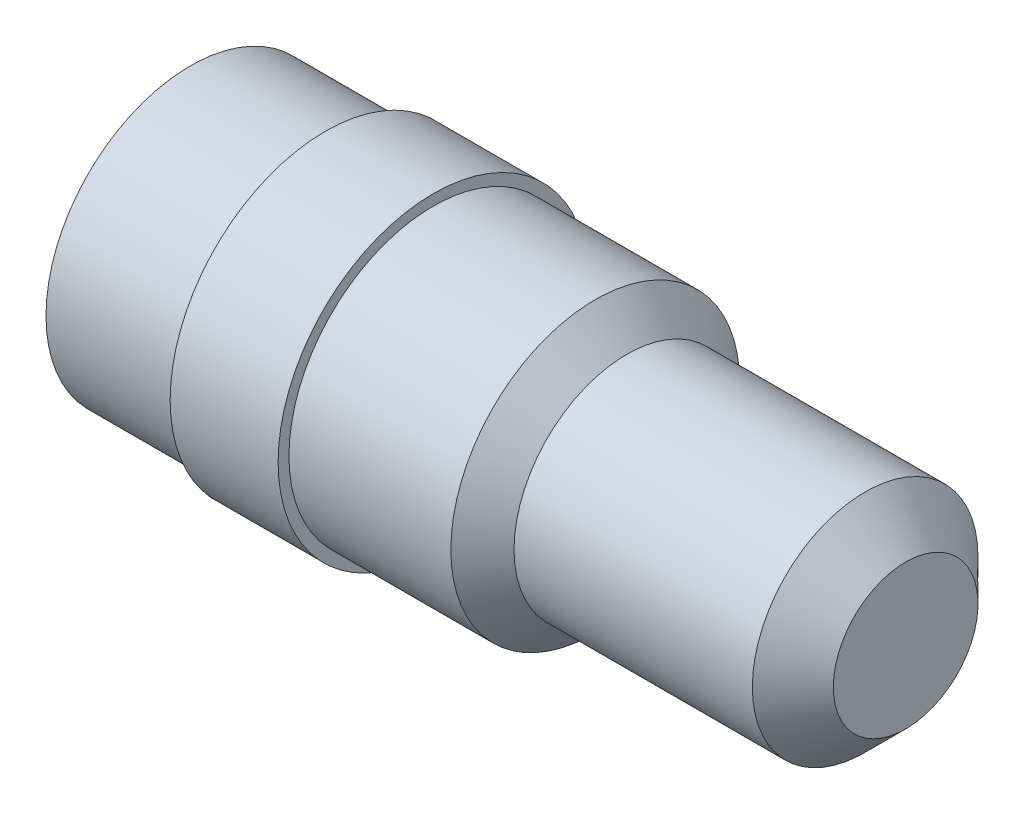
ISO-10303-21;
HEADER;
FILE_DESCRIPTION(('STEP AP214'),'2;1');
FILE_NAME('part.step','',(''),(''),'','','');
FILE_SCHEMA(('AUTOMOTIVE_DESIGN { 1 0 10303 214 1 1 1 1 }'));
ENDSEC;
DATA;
#1=APPLICATION_CONTEXT('core data for automotive mechanical design processes');
#2=APPLICATION_PROTOCOL_DEFINITION('international standard','automotive_design',2000,#1);
#3=PRODUCT_CONTEXT('',#1,'mechanical');
#4=PRODUCT('Part','Part','',(#3));
#5=PRODUCT_RELATED_PRODUCT_CATEGORY('part','',(#4));
#6=PRODUCT_DEFINITION_FORMATION('','',#4);
#7=PRODUCT_DEFINITION_CONTEXT('part definition',#1,'design');
#8=PRODUCT_DEFINITION('design','',#6,#7);
#9=PRODUCT_DEFINITION_SHAPE('','',#8);
#10=(LENGTH_UNIT() NAMED_UNIT(*) SI_UNIT(.MILLI.,.METRE.));
#11=(NAMED_UNIT(*) PLANE_ANGLE_UNIT() SI_UNIT($,.RADIAN.));
#12=(NAMED_UNIT(*) SI_UNIT($,.STERADIAN.) SOLID_ANGLE_UNIT());
#13=UNCERTAINTY_MEASURE_WITH_UNIT(LENGTH_MEASURE(1.E-05),#10,'distance_accuracy_value','');
#14=(GEOMETRIC_REPRESENTATION_CONTEXT(3) GLOBAL_UNCERTAINTY_ASSIGNED_CONTEXT((#13)) GLOBAL_UNIT_ASSIGNED_CONTEXT((#10,
#11,#12)) REPRESENTATION_CONTEXT('',''));
#15=CARTESIAN_POINT('',(0.,0.,0.));
#16=DIRECTION('',(0.,0.,1.));
#17=DIRECTION('',(1.,0.,0.));
#18=AXIS2_PLACEMENT_3D('',#15,#16,#17);
#19=CARTESIAN_POINT('',(0.,5.35,0.));
#20=DIRECTION('',(1.,0.,0.));
#21=DIRECTION('',(0.,0.,-1.));
#22=AXIS2_PLACEMENT_3D('',#19,#20,#21);
#23=PLANE('',#22);
#24=CARTESIAN_POINT('',(0.,0.,0.));
#25=DIRECTION('',(-1.,0.,0.));
#26=DIRECTION('',(0.,0.,1.));
#27=AXIS2_PLACEMENT_3D('',#24,#25,#26);
#28=CIRCLE('',#27,5.35);
#29=CARTESIAN_POINT('',(0.,0.,5.35));
#30=VERTEX_POINT('',#29);
#31=EDGE_CURVE('E62',#30,#30,#28,.T.);
#32=ORIENTED_EDGE('',*,*,#31,.T.);
#33=EDGE_LOOP('',(#32));
#34=FACE_BOUND('',#33,.T.);
#35=ADVANCED_FACE('F31',(#34),#23,.F.);
#36=CARTESIAN_POINT('',(26.5,0.,0.));
#37=DIRECTION('',(-1.,0.,0.));
#38=DIRECTION('',(0.,0.,1.));
#39=AXIS2_PLACEMENT_3D('',#36,#37,#38);
#40=PLANE('',#39);
#41=CARTESIAN_POINT('',(26.5,0.,0.));
#42=DIRECTION('',(-1.,0.,0.));
#43=DIRECTION('',(0.,0.,1.));
#44=AXIS2_PLACEMENT_3D('',#41,#42,#43);
#45=CIRCLE('',#44,2.68000000000001);
#46=CARTESIAN_POINT('',(26.5,0.,2.68000000000001));
#47=VERTEX_POINT('',#46);
#48=EDGE_CURVE('E10',#47,#47,#45,.T.);
#49=ORIENTED_EDGE('',*,*,#48,.F.);
#50=EDGE_LOOP('',(#49));
#51=FACE_BOUND('',#50,.T.);
#52=ADVANCED_FACE('F110',(#51),#40,.F.);
#53=CARTESIAN_POINT('',(26.5,0.,0.));
#54=DIRECTION('',(-1.,0.,0.));
#55=DIRECTION('',(0.,0.,1.));
#56=AXIS2_PLACEMENT_3D('',#53,#54,#55);
#57=CONICAL_SURFACE('',#56,2.68000000000001,0.785398163397443);
#58=CARTESIAN_POINT('',(25.,0.,0.));
#59=DIRECTION('',(-1.,0.,0.));
#60=DIRECTION('',(0.,0.,1.));
#61=AXIS2_PLACEMENT_3D('',#58,#59,#60);
#62=CIRCLE('',#61,4.18);
#63=CARTESIAN_POINT('',(25.,0.,4.18));
#64=VERTEX_POINT('',#63);
#65=EDGE_CURVE('E37',#64,#64,#62,.T.);
#66=ORIENTED_EDGE('',*,*,#65,.F.);
#67=EDGE_LOOP('',(#66));
#68=FACE_BOUND('',#67,.T.);
#69=ORIENTED_EDGE('',*,*,#48,.T.);
#70=EDGE_LOOP('',(#69));
#71=FACE_BOUND('',#70,.T.);
#72=ADVANCED_FACE('F105',(#68,#71),#57,.T.);
#73=CARTESIAN_POINT('',(0.,0.,0.));
#74=DIRECTION('',(-1.,0.,0.));
#75=DIRECTION('',(0.,0.,1.));
#76=AXIS2_PLACEMENT_3D('',#73,#74,#75);
#77=CYLINDRICAL_SURFACE('',#76,4.18);
#78=CARTESIAN_POINT('',(16.17,0.,0.));
#79=DIRECTION('',(-1.,0.,0.));
#80=DIRECTION('',(0.,0.,1.));
#81=AXIS2_PLACEMENT_3D('',#78,#79,#80);
#82=CIRCLE('',#81,4.18);
#83=CARTESIAN_POINT('',(16.17,0.,4.18));
#84=VERTEX_POINT('',#83);
#85=EDGE_CURVE('E41',#84,#84,#82,.T.);
#86=ORIENTED_EDGE('',*,*,#85,.F.);
#87=EDGE_LOOP('',(#86));
#88=FACE_BOUND('',#87,.T.);
#89=ORIENTED_EDGE('',*,*,#65,.T.);
#90=EDGE_LOOP('',(#89));
#91=FACE_BOUND('',#90,.T.);
#92=ADVANCED_FACE('F100',(#88,#91),#77,.T.);
#93=CARTESIAN_POINT('',(16.17,0.,0.));
#94=DIRECTION('',(-1.,0.,0.));
#95=DIRECTION('',(0.,0.,1.));
#96=AXIS2_PLACEMENT_3D('',#93,#94,#95);
#97=CONICAL_SURFACE('',#96,4.18,0.785398163397444);
#98=CARTESIAN_POINT('',(15.,0.,0.));
#99=DIRECTION('',(-1.,0.,0.));
#100=DIRECTION('',(0.,0.,1.));
#101=AXIS2_PLACEMENT_3D('',#98,#99,#100);
#102=CIRCLE('',#101,5.35);
#103=CARTESIAN_POINT('',(15.,0.,5.35));
#104=VERTEX_POINT('',#103);
#105=EDGE_CURVE('E45',#104,#104,#102,.T.);
#106=ORIENTED_EDGE('',*,*,#105,.F.);
#107=EDGE_LOOP('',(#106));
#108=FACE_BOUND('',#107,.T.);
#109=ORIENTED_EDGE('',*,*,#85,.T.);
#110=EDGE_LOOP('',(#109));
#111=FACE_BOUND('',#110,.T.);
#112=ADVANCED_FACE('F94',(#108,#111),#97,.T.);
#113=CARTESIAN_POINT('',(0.,0.,0.));
#114=DIRECTION('',(-1.,0.,0.));
#115=DIRECTION('',(0.,0.,1.));
#116=AXIS2_PLACEMENT_3D('',#113,#114,#115);
#117=CYLINDRICAL_SURFACE('',#116,5.35);
#118=CARTESIAN_POINT('',(9.,0.,0.));
#119=DIRECTION('',(-1.,0.,0.));
#120=DIRECTION('',(0.,0.,1.));
#121=AXIS2_PLACEMENT_3D('',#118,#119,#120);
#122=CIRCLE('',#121,5.35);
#123=CARTESIAN_POINT('',(9.,0.,5.35));
#124=VERTEX_POINT('',#123);
#125=EDGE_CURVE('E50',#124,#124,#122,.T.);
#126=ORIENTED_EDGE('',*,*,#125,.F.);
#127=EDGE_LOOP('',(#126));
#128=FACE_BOUND('',#127,.T.);
#129=ORIENTED_EDGE('',*,*,#105,.T.);
#130=EDGE_LOOP('',(#129));
#131=FACE_BOUND('',#130,.T.);
#132=ADVANCED_FACE('F88',(#128,#131),#117,.T.);
#133=CARTESIAN_POINT('',(9.,5.35,0.));
#134=DIRECTION('',(-1.,0.,0.));
#135=DIRECTION('',(0.,0.,1.));
#136=AXIS2_PLACEMENT_3D('',#133,#134,#135);
#137=PLANE('',#136);
#138=CARTESIAN_POINT('',(9.,0.,0.));
#139=DIRECTION('',(-1.,0.,0.));
#140=DIRECTION('',(0.,0.,1.));
#141=AXIS2_PLACEMENT_3D('',#138,#139,#140);
#142=CIRCLE('',#141,5.75);
#143=CARTESIAN_POINT('',(9.,0.,5.75));
#144=VERTEX_POINT('',#143);
#145=EDGE_CURVE('E53',#144,#144,#142,.T.);
#146=ORIENTED_EDGE('',*,*,#145,.F.);
#147=EDGE_LOOP('',(#146));
#148=FACE_BOUND('',#147,.T.);
#149=ORIENTED_EDGE('',*,*,#125,.T.);
#150=EDGE_LOOP('',(#149));
#151=FACE_BOUND('',#150,.T.);
#152=ADVANCED_FACE('F82',(#148,#151),#137,.F.);
#153=CARTESIAN_POINT('',(0.,0.,0.));
#154=DIRECTION('',(-1.,0.,0.));
#155=DIRECTION('',(0.,0.,1.));
#156=AXIS2_PLACEMENT_3D('',#153,#154,#155);
#157=CYLINDRICAL_SURFACE('',#156,5.75);
#158=CARTESIAN_POINT('',(5.,0.,0.));
#159=DIRECTION('',(-1.,0.,0.));
#160=DIRECTION('',(0.,0.,1.));
#161=AXIS2_PLACEMENT_3D('',#158,#159,#160);
#162=CIRCLE('',#161,5.75);
#163=CARTESIAN_POINT('',(5.,0.,5.75));
#164=VERTEX_POINT('',#163);
#165=EDGE_CURVE('E56',#164,#164,#162,.T.);
#166=ORIENTED_EDGE('',*,*,#165,.F.);
#167=EDGE_LOOP('',(#166));
#168=FACE_BOUND('',#167,.T.);
#169=ORIENTED_EDGE('',*,*,#145,.T.);
#170=EDGE_LOOP('',(#169));
#171=FACE_BOUND('',#170,.T.);
#172=ADVANCED_FACE('F76',(#168,#171),#157,.T.);
#173=CARTESIAN_POINT('',(5.,5.75,0.));
#174=DIRECTION('',(1.,0.,0.));
#175=DIRECTION('',(0.,0.,-1.));
#176=AXIS2_PLACEMENT_3D('',#173,#174,#175);
#177=PLANE('',#176);
#178=CARTESIAN_POINT('',(5.,0.,0.));
#179=DIRECTION('',(-1.,0.,0.));
#180=DIRECTION('',(0.,0.,1.));
#181=AXIS2_PLACEMENT_3D('',#178,#179,#180);
#182=CIRCLE('',#181,5.35);
#183=CARTESIAN_POINT('',(5.,0.,5.35));
#184=VERTEX_POINT('',#183);
#185=EDGE_CURVE('E59',#184,#184,#182,.T.);
#186=ORIENTED_EDGE('',*,*,#185,.F.);
#187=EDGE_LOOP('',(#186));
#188=FACE_BOUND('',#187,.T.);
#189=ORIENTED_EDGE('',*,*,#165,.T.);
#190=EDGE_LOOP('',(#189));
#191=FACE_BOUND('',#190,.T.);
#192=ADVANCED_FACE('F70',(#188,#191),#177,.F.);
#193=CARTESIAN_POINT('',(0.,0.,0.));
#194=DIRECTION('',(-1.,0.,0.));
#195=DIRECTION('',(0.,0.,1.));
#196=AXIS2_PLACEMENT_3D('',#193,#194,#195);
#197=CYLINDRICAL_SURFACE('',#196,5.35);
#198=ORIENTED_EDGE('',*,*,#31,.F.);
#199=EDGE_LOOP('',(#198));
#200=FACE_BOUND('',#199,.T.);
#201=ORIENTED_EDGE('',*,*,#185,.T.);
#202=EDGE_LOOP('',(#201));
#203=FACE_BOUND('',#202,.T.);
#204=ADVANCED_FACE('F67',(#200,#203),#197,.T.);
#205=CLOSED_SHELL('',(#35,#52,#72,#92,#112,#132,#152,#172,#192,#204));
#206=MANIFOLD_SOLID_BREP('B2',#205);
#207=ADVANCED_BREP_SHAPE_REPRESENTATION('',(#18,#206),#14);
#208=SHAPE_DEFINITION_REPRESENTATION(#9,#207);
ENDSEC;
END-ISO-10303-21;
